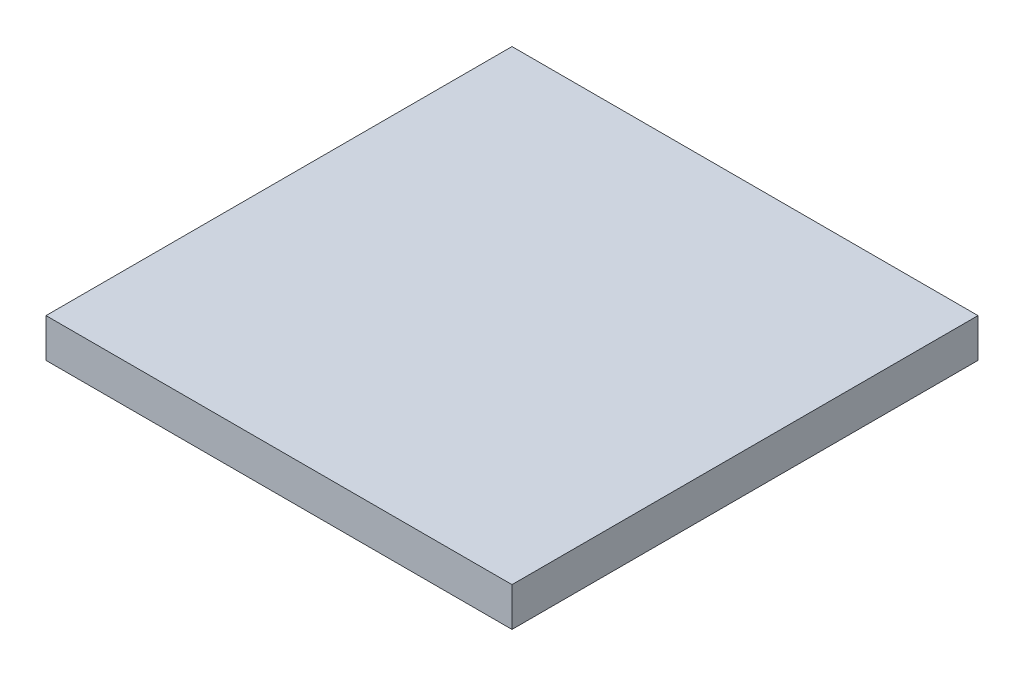
ISO-10303-21;
HEADER;
FILE_DESCRIPTION(('STEP AP214'),'2;1');
FILE_NAME('part.step','',(''),(''),'','','');
FILE_SCHEMA(('AUTOMOTIVE_DESIGN { 1 0 10303 214 1 1 1 1 }'));
ENDSEC;
DATA;
#1=APPLICATION_CONTEXT('core data for automotive mechanical design processes');
#2=APPLICATION_PROTOCOL_DEFINITION('international standard','automotive_design',2000,#1);
#3=PRODUCT_CONTEXT('',#1,'mechanical');
#4=PRODUCT('Part','Part','',(#3));
#5=PRODUCT_RELATED_PRODUCT_CATEGORY('part','',(#4));
#6=PRODUCT_DEFINITION_FORMATION('','',#4);
#7=PRODUCT_DEFINITION_CONTEXT('part definition',#1,'design');
#8=PRODUCT_DEFINITION('design','',#6,#7);
#9=PRODUCT_DEFINITION_SHAPE('','',#8);
#10=(LENGTH_UNIT() NAMED_UNIT(*) SI_UNIT(.MILLI.,.METRE.));
#11=(NAMED_UNIT(*) PLANE_ANGLE_UNIT() SI_UNIT($,.RADIAN.));
#12=(NAMED_UNIT(*) SI_UNIT($,.STERADIAN.) SOLID_ANGLE_UNIT());
#13=UNCERTAINTY_MEASURE_WITH_UNIT(LENGTH_MEASURE(1.E-05),#10,'distance_accuracy_value','');
#14=(GEOMETRIC_REPRESENTATION_CONTEXT(3) GLOBAL_UNCERTAINTY_ASSIGNED_CONTEXT((#13)) GLOBAL_UNIT_ASSIGNED_CONTEXT((#10,
#11,#12)) REPRESENTATION_CONTEXT('',''));
#15=CARTESIAN_POINT('',(0.,0.,0.));
#16=DIRECTION('',(0.,0.,1.));
#17=DIRECTION('',(1.,0.,0.));
#18=AXIS2_PLACEMENT_3D('',#15,#16,#17);
#19=CARTESIAN_POINT('',(0.,1.,0.));
#20=DIRECTION('',(1.,0.,0.));
#21=DIRECTION('',(0.,0.,-1.));
#22=AXIS2_PLACEMENT_3D('',#19,#20,#21);
#23=PLANE('',#22);
#24=DIRECTION('',(0.,0.,1.));
#25=VECTOR('',#24,1.);
#26=CARTESIAN_POINT('',(0.,0.,0.));
#27=LINE('',#26,#25);
#28=CARTESIAN_POINT('',(0.,0.,-12.));
#29=VERTEX_POINT('',#28);
#30=CARTESIAN_POINT('',(0.,0.,0.));
#31=VERTEX_POINT('',#30);
#32=EDGE_CURVE('E105',#29,#31,#27,.T.);
#33=ORIENTED_EDGE('',*,*,#32,.T.);
#34=DIRECTION('',(0.,-1.,0.));
#35=VECTOR('',#34,1.);
#36=CARTESIAN_POINT('',(0.,1.,0.));
#37=LINE('',#36,#35);
#38=CARTESIAN_POINT('',(0.,1.,0.));
#39=VERTEX_POINT('',#38);
#40=EDGE_CURVE('E11',#39,#31,#37,.T.);
#41=ORIENTED_EDGE('',*,*,#40,.F.);
#42=DIRECTION('',(0.,0.,1.));
#43=VECTOR('',#42,1.);
#44=CARTESIAN_POINT('',(0.,1.,0.));
#45=LINE('',#44,#43);
#46=CARTESIAN_POINT('',(0.,1.,-12.));
#47=VERTEX_POINT('',#46);
#48=EDGE_CURVE('E93',#47,#39,#45,.T.);
#49=ORIENTED_EDGE('',*,*,#48,.F.);
#50=DIRECTION('',(0.,-1.,0.));
#51=VECTOR('',#50,1.);
#52=CARTESIAN_POINT('',(0.,1.,-12.));
#53=LINE('',#52,#51);
#54=EDGE_CURVE('E101',#47,#29,#53,.T.);
#55=ORIENTED_EDGE('',*,*,#54,.T.);
#56=EDGE_LOOP('',(#33,#41,#49,#55));
#57=FACE_BOUND('',#56,.T.);
#58=ADVANCED_FACE('F42',(#57),#23,.F.);
#59=CARTESIAN_POINT('',(0.,1.,0.));
#60=DIRECTION('',(0.,0.,-1.));
#61=DIRECTION('',(-1.,0.,0.));
#62=AXIS2_PLACEMENT_3D('',#59,#60,#61);
#63=PLANE('',#62);
#64=DIRECTION('',(1.,0.,0.));
#65=VECTOR('',#64,1.);
#66=CARTESIAN_POINT('',(0.,0.,0.));
#67=LINE('',#66,#65);
#68=CARTESIAN_POINT('',(12.,0.,0.));
#69=VERTEX_POINT('',#68);
#70=EDGE_CURVE('E97',#31,#69,#67,.T.);
#71=ORIENTED_EDGE('',*,*,#70,.T.);
#72=DIRECTION('',(0.,-1.,0.));
#73=VECTOR('',#72,1.);
#74=CARTESIAN_POINT('',(12.,1.,0.));
#75=LINE('',#74,#73);
#76=CARTESIAN_POINT('',(12.,1.,0.));
#77=VERTEX_POINT('',#76);
#78=EDGE_CURVE('E50',#77,#69,#75,.T.);
#79=ORIENTED_EDGE('',*,*,#78,.F.);
#80=DIRECTION('',(1.,0.,0.));
#81=VECTOR('',#80,1.);
#82=CARTESIAN_POINT('',(0.,1.,0.));
#83=LINE('',#82,#81);
#84=EDGE_CURVE('E88',#39,#77,#83,.T.);
#85=ORIENTED_EDGE('',*,*,#84,.F.);
#86=ORIENTED_EDGE('',*,*,#40,.T.);
#87=EDGE_LOOP('',(#71,#79,#85,#86));
#88=FACE_BOUND('',#87,.T.);
#89=ADVANCED_FACE('F96',(#88),#63,.F.);
#90=CARTESIAN_POINT('',(12.,1.,0.));
#91=DIRECTION('',(-1.,0.,0.));
#92=DIRECTION('',(0.,0.,1.));
#93=AXIS2_PLACEMENT_3D('',#90,#91,#92);
#94=PLANE('',#93);
#95=DIRECTION('',(0.,0.,-1.));
#96=VECTOR('',#95,1.);
#97=CARTESIAN_POINT('',(12.,0.,0.));
#98=LINE('',#97,#96);
#99=CARTESIAN_POINT('',(12.,0.,-12.));
#100=VERTEX_POINT('',#99);
#101=EDGE_CURVE('E75',#69,#100,#98,.T.);
#102=ORIENTED_EDGE('',*,*,#101,.T.);
#103=DIRECTION('',(0.,-1.,0.));
#104=VECTOR('',#103,1.);
#105=CARTESIAN_POINT('',(12.,1.,-12.));
#106=LINE('',#105,#104);
#107=CARTESIAN_POINT('',(12.,1.,-12.));
#108=VERTEX_POINT('',#107);
#109=EDGE_CURVE('E98',#108,#100,#106,.T.);
#110=ORIENTED_EDGE('',*,*,#109,.F.);
#111=DIRECTION('',(0.,0.,-1.));
#112=VECTOR('',#111,1.);
#113=CARTESIAN_POINT('',(12.,1.,0.));
#114=LINE('',#113,#112);
#115=EDGE_CURVE('E91',#77,#108,#114,.T.);
#116=ORIENTED_EDGE('',*,*,#115,.F.);
#117=ORIENTED_EDGE('',*,*,#78,.T.);
#118=EDGE_LOOP('',(#102,#110,#116,#117));
#119=FACE_BOUND('',#118,.T.);
#120=ADVANCED_FACE('F99',(#119),#94,.F.);
#121=CARTESIAN_POINT('',(0.,1.,-12.));
#122=DIRECTION('',(0.,0.,1.));
#123=DIRECTION('',(1.,0.,0.));
#124=AXIS2_PLACEMENT_3D('',#121,#122,#123);
#125=PLANE('',#124);
#126=DIRECTION('',(-1.,0.,0.));
#127=VECTOR('',#126,1.);
#128=CARTESIAN_POINT('',(0.,0.,-12.));
#129=LINE('',#128,#127);
#130=EDGE_CURVE('E81',#100,#29,#129,.T.);
#131=ORIENTED_EDGE('',*,*,#130,.T.);
#132=ORIENTED_EDGE('',*,*,#54,.F.);
#133=DIRECTION('',(-1.,0.,0.));
#134=VECTOR('',#133,1.);
#135=CARTESIAN_POINT('',(0.,1.,-12.));
#136=LINE('',#135,#134);
#137=EDGE_CURVE('E58',#108,#47,#136,.T.);
#138=ORIENTED_EDGE('',*,*,#137,.F.);
#139=ORIENTED_EDGE('',*,*,#109,.T.);
#140=EDGE_LOOP('',(#131,#132,#138,#139));
#141=FACE_BOUND('',#140,.T.);
#142=ADVANCED_FACE('F112',(#141),#125,.F.);
#143=CARTESIAN_POINT('',(0.,1.,0.));
#144=DIRECTION('',(0.,-1.,0.));
#145=DIRECTION('',(0.,0.,-1.));
#146=AXIS2_PLACEMENT_3D('',#143,#144,#145);
#147=PLANE('',#146);
#148=ORIENTED_EDGE('',*,*,#48,.T.);
#149=ORIENTED_EDGE('',*,*,#84,.T.);
#150=ORIENTED_EDGE('',*,*,#115,.T.);
#151=ORIENTED_EDGE('',*,*,#137,.T.);
#152=EDGE_LOOP('',(#148,#149,#150,#151));
#153=FACE_BOUND('',#152,.T.);
#154=ADVANCED_FACE('F89',(#153),#147,.F.);
#155=CARTESIAN_POINT('',(0.,0.,0.));
#156=DIRECTION('',(0.,-1.,0.));
#157=DIRECTION('',(0.,0.,-1.));
#158=AXIS2_PLACEMENT_3D('',#155,#156,#157);
#159=PLANE('',#158);
#160=ORIENTED_EDGE('',*,*,#32,.F.);
#161=ORIENTED_EDGE('',*,*,#130,.F.);
#162=ORIENTED_EDGE('',*,*,#101,.F.);
#163=ORIENTED_EDGE('',*,*,#70,.F.);
#164=EDGE_LOOP('',(#160,#161,#162,#163));
#165=FACE_BOUND('',#164,.T.);
#166=ADVANCED_FACE('F115',(#165),#159,.T.);
#167=CLOSED_SHELL('',(#58,#89,#120,#142,#154,#166));
#168=MANIFOLD_SOLID_BREP('B2',#167);
#169=ADVANCED_BREP_SHAPE_REPRESENTATION('',(#18,#168),#14);
#170=SHAPE_DEFINITION_REPRESENTATION(#9,#169);
ENDSEC;
END-ISO-10303-21;
